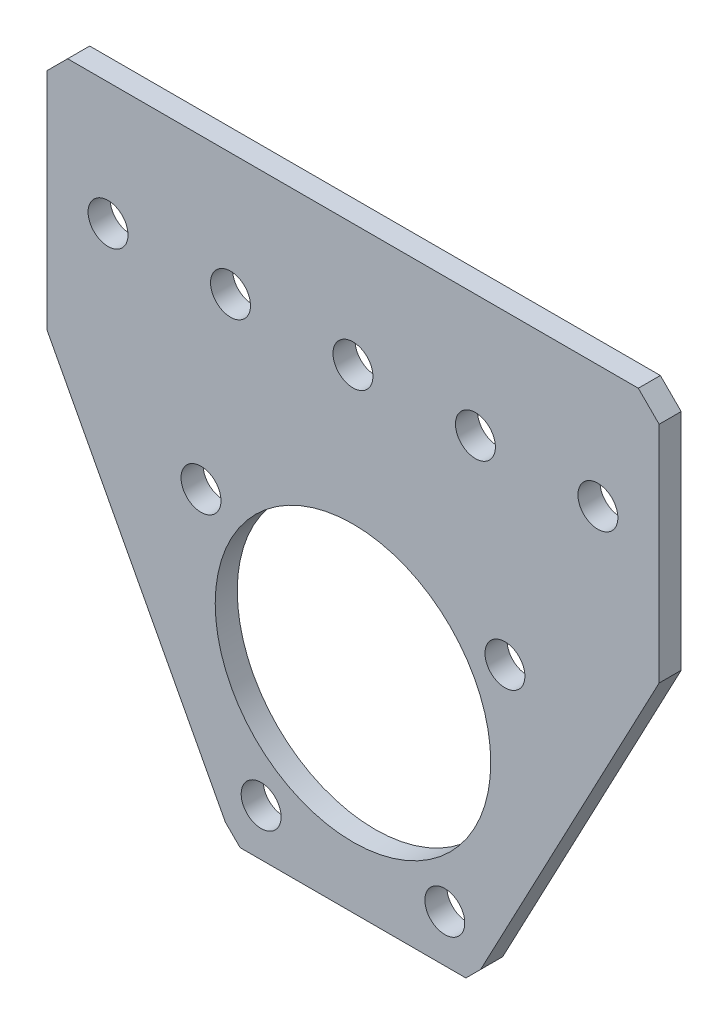
ISO-10303-21;
HEADER;
FILE_DESCRIPTION(('STEP AP214'),'2;1');
FILE_NAME('part.step','',(''),(''),'','','');
FILE_SCHEMA(('AUTOMOTIVE_DESIGN { 1 0 10303 214 1 1 1 1 }'));
ENDSEC;
DATA;
#1=APPLICATION_CONTEXT('core data for automotive mechanical design processes');
#2=APPLICATION_PROTOCOL_DEFINITION('international standard','automotive_design',2000,#1);
#3=PRODUCT_CONTEXT('',#1,'mechanical');
#4=PRODUCT('Part','Part','',(#3));
#5=PRODUCT_RELATED_PRODUCT_CATEGORY('part','',(#4));
#6=PRODUCT_DEFINITION_FORMATION('','',#4);
#7=PRODUCT_DEFINITION_CONTEXT('part definition',#1,'design');
#8=PRODUCT_DEFINITION('design','',#6,#7);
#9=PRODUCT_DEFINITION_SHAPE('','',#8);
#10=(LENGTH_UNIT() NAMED_UNIT(*) SI_UNIT(.MILLI.,.METRE.));
#11=(NAMED_UNIT(*) PLANE_ANGLE_UNIT() SI_UNIT($,.RADIAN.));
#12=(NAMED_UNIT(*) SI_UNIT($,.STERADIAN.) SOLID_ANGLE_UNIT());
#13=UNCERTAINTY_MEASURE_WITH_UNIT(LENGTH_MEASURE(1.E-05),#10,'distance_accuracy_value','');
#14=(GEOMETRIC_REPRESENTATION_CONTEXT(3) GLOBAL_UNCERTAINTY_ASSIGNED_CONTEXT((#13)) GLOBAL_UNIT_ASSIGNED_CONTEXT((#10,
#11,#12)) REPRESENTATION_CONTEXT('',''));
#15=CARTESIAN_POINT('',(0.,0.,0.));
#16=DIRECTION('',(0.,0.,1.));
#17=DIRECTION('',(1.,0.,0.));
#18=AXIS2_PLACEMENT_3D('',#15,#16,#17);
#19=CARTESIAN_POINT('',(31.75,41.275,0.));
#20=DIRECTION('',(0.,0.,-1.));
#21=DIRECTION('',(-1.,0.,0.));
#22=AXIS2_PLACEMENT_3D('',#19,#20,#21);
#23=PLANE('',#22);
#24=DIRECTION('',(0.707106781186548,-0.707106781186548,0.));
#25=VECTOR('',#24,1.);
#26=CARTESIAN_POINT('',(29.591,41.275,0.));
#27=LINE('',#26,#25);
#28=CARTESIAN_POINT('',(29.591,41.275,0.));
#29=VERTEX_POINT('',#28);
#30=CARTESIAN_POINT('',(31.75,39.116,0.));
#31=VERTEX_POINT('',#30);
#32=EDGE_CURVE('E476',#29,#31,#27,.T.);
#33=ORIENTED_EDGE('',*,*,#32,.T.);
#34=DIRECTION('',(0.,1.,0.));
#35=VECTOR('',#34,1.);
#36=CARTESIAN_POINT('',(31.75,15.875,0.));
#37=LINE('',#36,#35);
#38=CARTESIAN_POINT('',(31.75,15.875,0.));
#39=VERTEX_POINT('',#38);
#40=EDGE_CURVE('E471',#31,#39,#37,.F.);
#41=ORIENTED_EDGE('',*,*,#40,.T.);
#42=DIRECTION('',(-0.46773621594641,-0.883868107973205,0.));
#43=VECTOR('',#42,1.);
#44=CARTESIAN_POINT('',(31.75,15.875,0.));
#45=LINE('',#44,#43);
#46=CARTESIAN_POINT('',(13.2357534010395,-19.1108564594182,0.));
#47=VERTEX_POINT('',#46);
#48=EDGE_CURVE('E466',#39,#47,#45,.T.);
#49=ORIENTED_EDGE('',*,*,#48,.T.);
#50=DIRECTION('',(0.70710678118655,0.707106781186545,0.));
#51=VECTOR('',#50,1.);
#52=CARTESIAN_POINT('',(16.1733049302288,-16.173304930229,0.));
#53=LINE('',#52,#51);
#54=CARTESIAN_POINT('',(11.7091098604577,-20.6375,0.));
#55=VERTEX_POINT('',#54);
#56=EDGE_CURVE('E108',#55,#47,#53,.T.);
#57=ORIENTED_EDGE('',*,*,#56,.F.);
#58=DIRECTION('',(-1.,0.,0.));
#59=VECTOR('',#58,1.);
#60=CARTESIAN_POINT('',(12.4278653617164,-20.6375,0.));
#61=LINE('',#60,#59);
#62=CARTESIAN_POINT('',(-11.7091098604578,-20.6375,0.));
#63=VERTEX_POINT('',#62);
#64=EDGE_CURVE('E103',#55,#63,#61,.T.);
#65=ORIENTED_EDGE('',*,*,#64,.T.);
#66=DIRECTION('',(0.707106781186544,-0.707106781186551,0.));
#67=VECTOR('',#66,1.);
#68=CARTESIAN_POINT('',(-16.1733049302289,-16.1733049302288,0.));
#69=LINE('',#68,#67);
#70=CARTESIAN_POINT('',(-13.2357534010395,-19.1108564594182,0.));
#71=VERTEX_POINT('',#70);
#72=EDGE_CURVE('E94',#71,#63,#69,.T.);
#73=ORIENTED_EDGE('',*,*,#72,.F.);
#74=DIRECTION('',(-0.46773621594641,0.883868107973205,0.));
#75=VECTOR('',#74,1.);
#76=CARTESIAN_POINT('',(-31.75,15.875,0.));
#77=LINE('',#76,#75);
#78=CARTESIAN_POINT('',(-31.75,15.875,0.));
#79=VERTEX_POINT('',#78);
#80=EDGE_CURVE('E89',#71,#79,#77,.T.);
#81=ORIENTED_EDGE('',*,*,#80,.T.);
#82=DIRECTION('',(0.,1.,0.));
#83=VECTOR('',#82,1.);
#84=CARTESIAN_POINT('',(-31.75,15.875,0.));
#85=LINE('',#84,#83);
#86=CARTESIAN_POINT('',(-31.75,39.116,0.));
#87=VERTEX_POINT('',#86);
#88=EDGE_CURVE('E491',#79,#87,#85,.T.);
#89=ORIENTED_EDGE('',*,*,#88,.T.);
#90=DIRECTION('',(0.707106781186548,0.707106781186548,0.));
#91=VECTOR('',#90,1.);
#92=CARTESIAN_POINT('',(-31.75,39.116,0.));
#93=LINE('',#92,#91);
#94=CARTESIAN_POINT('',(-29.591,41.275,0.));
#95=VERTEX_POINT('',#94);
#96=EDGE_CURVE('E486',#87,#95,#93,.T.);
#97=ORIENTED_EDGE('',*,*,#96,.T.);
#98=DIRECTION('',(1.,0.,0.));
#99=VECTOR('',#98,1.);
#100=CARTESIAN_POINT('',(-31.75,41.275,0.));
#101=LINE('',#100,#99);
#102=EDGE_CURVE('E481',#95,#29,#101,.T.);
#103=ORIENTED_EDGE('',*,*,#102,.T.);
#104=EDGE_LOOP('',(#33,#41,#49,#57,#65,#73,#81,#89,#97,#103));
#105=FACE_BOUND('',#104,.T.);
#106=CARTESIAN_POINT('',(15.7602855304084,9.525,0.));
#107=DIRECTION('',(0.,0.,-1.));
#108=DIRECTION('',(-1.,0.,0.));
#109=AXIS2_PLACEMENT_3D('',#106,#107,#108);
#110=CIRCLE('',#109,2.0701);
#111=CARTESIAN_POINT('',(13.6901855304084,9.525,0.));
#112=VERTEX_POINT('',#111);
#113=EDGE_CURVE('E112',#112,#112,#110,.F.);
#114=ORIENTED_EDGE('',*,*,#113,.T.);
#115=EDGE_LOOP('',(#114));
#116=FACE_BOUND('',#115,.T.);
#117=CARTESIAN_POINT('',(-9.525,-15.7602855304084,0.));
#118=DIRECTION('',(0.,0.,-1.));
#119=DIRECTION('',(-1.,0.,0.));
#120=AXIS2_PLACEMENT_3D('',#117,#118,#119);
#121=CIRCLE('',#120,2.0701);
#122=CARTESIAN_POINT('',(-11.5951,-15.7602855304084,0.));
#123=VERTEX_POINT('',#122);
#124=EDGE_CURVE('E153',#123,#123,#121,.F.);
#125=ORIENTED_EDGE('',*,*,#124,.T.);
#126=EDGE_LOOP('',(#125));
#127=FACE_BOUND('',#126,.T.);
#128=CARTESIAN_POINT('',(12.7,28.575,0.));
#129=DIRECTION('',(0.,0.,-1.));
#130=DIRECTION('',(-1.,0.,0.));
#131=AXIS2_PLACEMENT_3D('',#128,#129,#130);
#132=CIRCLE('',#131,2.0701);
#133=CARTESIAN_POINT('',(10.6299,28.575,0.));
#134=VERTEX_POINT('',#133);
#135=EDGE_CURVE('E156',#134,#134,#132,.F.);
#136=ORIENTED_EDGE('',*,*,#135,.T.);
#137=EDGE_LOOP('',(#136));
#138=FACE_BOUND('',#137,.T.);
#139=CARTESIAN_POINT('',(-12.7,28.575,0.));
#140=DIRECTION('',(0.,0.,-1.));
#141=DIRECTION('',(-1.,0.,0.));
#142=AXIS2_PLACEMENT_3D('',#139,#140,#141);
#143=CIRCLE('',#142,2.0701);
#144=CARTESIAN_POINT('',(-14.7701,28.575,0.));
#145=VERTEX_POINT('',#144);
#146=EDGE_CURVE('E159',#145,#145,#143,.F.);
#147=ORIENTED_EDGE('',*,*,#146,.T.);
#148=EDGE_LOOP('',(#147));
#149=FACE_BOUND('',#148,.T.);
#150=CARTESIAN_POINT('',(-25.4,28.575,0.));
#151=DIRECTION('',(0.,0.,-1.));
#152=DIRECTION('',(-1.,0.,0.));
#153=AXIS2_PLACEMENT_3D('',#150,#151,#152);
#154=CIRCLE('',#153,2.0701);
#155=CARTESIAN_POINT('',(-27.4701,28.575,0.));
#156=VERTEX_POINT('',#155);
#157=EDGE_CURVE('E162',#156,#156,#154,.F.);
#158=ORIENTED_EDGE('',*,*,#157,.T.);
#159=EDGE_LOOP('',(#158));
#160=FACE_BOUND('',#159,.T.);
#161=CARTESIAN_POINT('',(0.,0.,0.));
#162=DIRECTION('',(0.,0.,-1.));
#163=DIRECTION('',(-1.,0.,0.));
#164=AXIS2_PLACEMENT_3D('',#161,#162,#163);
#165=CIRCLE('',#164,14.2875);
#166=CARTESIAN_POINT('',(-14.2875,0.,0.));
#167=VERTEX_POINT('',#166);
#168=EDGE_CURVE('E165',#167,#167,#165,.F.);
#169=ORIENTED_EDGE('',*,*,#168,.T.);
#170=EDGE_LOOP('',(#169));
#171=FACE_BOUND('',#170,.T.);
#172=CARTESIAN_POINT('',(25.4,28.575,0.));
#173=DIRECTION('',(0.,0.,-1.));
#174=DIRECTION('',(-1.,0.,0.));
#175=AXIS2_PLACEMENT_3D('',#172,#173,#174);
#176=CIRCLE('',#175,2.0701);
#177=CARTESIAN_POINT('',(23.3299,28.575,0.));
#178=VERTEX_POINT('',#177);
#179=EDGE_CURVE('E168',#178,#178,#176,.F.);
#180=ORIENTED_EDGE('',*,*,#179,.T.);
#181=EDGE_LOOP('',(#180));
#182=FACE_BOUND('',#181,.T.);
#183=CARTESIAN_POINT('',(0.,28.575,0.));
#184=DIRECTION('',(0.,0.,-1.));
#185=DIRECTION('',(-1.,0.,0.));
#186=AXIS2_PLACEMENT_3D('',#183,#184,#185);
#187=CIRCLE('',#186,2.0701);
#188=CARTESIAN_POINT('',(-2.0701,28.575,0.));
#189=VERTEX_POINT('',#188);
#190=EDGE_CURVE('E171',#189,#189,#187,.F.);
#191=ORIENTED_EDGE('',*,*,#190,.T.);
#192=EDGE_LOOP('',(#191));
#193=FACE_BOUND('',#192,.T.);
#194=CARTESIAN_POINT('',(-15.7602855304084,9.525,0.));
#195=DIRECTION('',(0.,0.,-1.));
#196=DIRECTION('',(-1.,0.,0.));
#197=AXIS2_PLACEMENT_3D('',#194,#195,#196);
#198=CIRCLE('',#197,2.0701);
#199=CARTESIAN_POINT('',(-17.8303855304084,9.525,0.));
#200=VERTEX_POINT('',#199);
#201=EDGE_CURVE('E173',#200,#200,#198,.F.);
#202=ORIENTED_EDGE('',*,*,#201,.T.);
#203=EDGE_LOOP('',(#202));
#204=FACE_BOUND('',#203,.T.);
#205=CARTESIAN_POINT('',(9.525,-15.7602855304084,0.));
#206=DIRECTION('',(0.,0.,-1.));
#207=DIRECTION('',(-1.,0.,0.));
#208=AXIS2_PLACEMENT_3D('',#205,#206,#207);
#209=CIRCLE('',#208,2.0701);
#210=CARTESIAN_POINT('',(7.4549,-15.7602855304084,0.));
#211=VERTEX_POINT('',#210);
#212=EDGE_CURVE('E20',#211,#211,#209,.F.);
#213=ORIENTED_EDGE('',*,*,#212,.T.);
#214=EDGE_LOOP('',(#213));
#215=FACE_BOUND('',#214,.T.);
#216=ADVANCED_FACE('F17',(#105,#116,#127,#138,#149,#160,#171,#182,#193,#204,#215),#23,.T.);
#217=CARTESIAN_POINT('',(9.525,-15.7602855304084,2.286));
#218=DIRECTION('',(0.,0.,-1.));
#219=DIRECTION('',(-1.,0.,0.));
#220=AXIS2_PLACEMENT_3D('',#217,#218,#219);
#221=CYLINDRICAL_SURFACE('',#220,2.0701);
#222=ORIENTED_EDGE('',*,*,#212,.F.);
#223=EDGE_LOOP('',(#222));
#224=FACE_BOUND('',#223,.T.);
#225=CARTESIAN_POINT('',(9.525,-15.7602855304084,2.286));
#226=DIRECTION('',(0.,0.,-1.));
#227=DIRECTION('',(-1.,0.,0.));
#228=AXIS2_PLACEMENT_3D('',#225,#226,#227);
#229=CIRCLE('',#228,2.0701);
#230=CARTESIAN_POINT('',(7.4549,-15.7602855304084,2.286));
#231=VERTEX_POINT('',#230);
#232=EDGE_CURVE('E148',#231,#231,#229,.F.);
#233=ORIENTED_EDGE('',*,*,#232,.T.);
#234=EDGE_LOOP('',(#233));
#235=FACE_BOUND('',#234,.T.);
#236=ADVANCED_FACE('F181',(#224,#235),#221,.F.);
#237=CARTESIAN_POINT('',(-15.7602855304084,9.525,2.286));
#238=DIRECTION('',(0.,0.,-1.));
#239=DIRECTION('',(-1.,0.,0.));
#240=AXIS2_PLACEMENT_3D('',#237,#238,#239);
#241=CYLINDRICAL_SURFACE('',#240,2.0701);
#242=ORIENTED_EDGE('',*,*,#201,.F.);
#243=EDGE_LOOP('',(#242));
#244=FACE_BOUND('',#243,.T.);
#245=CARTESIAN_POINT('',(-15.7602855304084,9.525,2.286));
#246=DIRECTION('',(0.,0.,-1.));
#247=DIRECTION('',(-1.,0.,0.));
#248=AXIS2_PLACEMENT_3D('',#245,#246,#247);
#249=CIRCLE('',#248,2.0701);
#250=CARTESIAN_POINT('',(-17.8303855304084,9.525,2.286));
#251=VERTEX_POINT('',#250);
#252=EDGE_CURVE('E145',#251,#251,#249,.F.);
#253=ORIENTED_EDGE('',*,*,#252,.T.);
#254=EDGE_LOOP('',(#253));
#255=FACE_BOUND('',#254,.T.);
#256=ADVANCED_FACE('F184',(#244,#255),#241,.F.);
#257=CARTESIAN_POINT('',(0.,28.575,2.286));
#258=DIRECTION('',(0.,0.,-1.));
#259=DIRECTION('',(-1.,0.,0.));
#260=AXIS2_PLACEMENT_3D('',#257,#258,#259);
#261=CYLINDRICAL_SURFACE('',#260,2.0701);
#262=ORIENTED_EDGE('',*,*,#190,.F.);
#263=EDGE_LOOP('',(#262));
#264=FACE_BOUND('',#263,.T.);
#265=CARTESIAN_POINT('',(0.,28.575,2.286));
#266=DIRECTION('',(0.,0.,-1.));
#267=DIRECTION('',(-1.,0.,0.));
#268=AXIS2_PLACEMENT_3D('',#265,#266,#267);
#269=CIRCLE('',#268,2.0701);
#270=CARTESIAN_POINT('',(-2.0701,28.575,2.286));
#271=VERTEX_POINT('',#270);
#272=EDGE_CURVE('E142',#271,#271,#269,.F.);
#273=ORIENTED_EDGE('',*,*,#272,.T.);
#274=EDGE_LOOP('',(#273));
#275=FACE_BOUND('',#274,.T.);
#276=ADVANCED_FACE('F258',(#264,#275),#261,.F.);
#277=CARTESIAN_POINT('',(25.4,28.575,2.286));
#278=DIRECTION('',(0.,0.,-1.));
#279=DIRECTION('',(-1.,0.,0.));
#280=AXIS2_PLACEMENT_3D('',#277,#278,#279);
#281=CYLINDRICAL_SURFACE('',#280,2.0701);
#282=ORIENTED_EDGE('',*,*,#179,.F.);
#283=EDGE_LOOP('',(#282));
#284=FACE_BOUND('',#283,.T.);
#285=CARTESIAN_POINT('',(25.4,28.575,2.286));
#286=DIRECTION('',(0.,0.,-1.));
#287=DIRECTION('',(-1.,0.,0.));
#288=AXIS2_PLACEMENT_3D('',#285,#286,#287);
#289=CIRCLE('',#288,2.0701);
#290=CARTESIAN_POINT('',(23.3299,28.575,2.286));
#291=VERTEX_POINT('',#290);
#292=EDGE_CURVE('E139',#291,#291,#289,.F.);
#293=ORIENTED_EDGE('',*,*,#292,.T.);
#294=EDGE_LOOP('',(#293));
#295=FACE_BOUND('',#294,.T.);
#296=ADVANCED_FACE('F254',(#284,#295),#281,.F.);
#297=CARTESIAN_POINT('',(0.,0.,2.286));
#298=DIRECTION('',(0.,0.,-1.));
#299=DIRECTION('',(-1.,0.,0.));
#300=AXIS2_PLACEMENT_3D('',#297,#298,#299);
#301=CYLINDRICAL_SURFACE('',#300,14.2875);
#302=ORIENTED_EDGE('',*,*,#168,.F.);
#303=EDGE_LOOP('',(#302));
#304=FACE_BOUND('',#303,.T.);
#305=CARTESIAN_POINT('',(0.,0.,2.286));
#306=DIRECTION('',(0.,0.,-1.));
#307=DIRECTION('',(-1.,0.,0.));
#308=AXIS2_PLACEMENT_3D('',#305,#306,#307);
#309=CIRCLE('',#308,14.2875);
#310=CARTESIAN_POINT('',(-14.2875,0.,2.286));
#311=VERTEX_POINT('',#310);
#312=EDGE_CURVE('E136',#311,#311,#309,.F.);
#313=ORIENTED_EDGE('',*,*,#312,.T.);
#314=EDGE_LOOP('',(#313));
#315=FACE_BOUND('',#314,.T.);
#316=ADVANCED_FACE('F250',(#304,#315),#301,.F.);
#317=CARTESIAN_POINT('',(-25.4,28.575,2.286));
#318=DIRECTION('',(0.,0.,-1.));
#319=DIRECTION('',(-1.,0.,0.));
#320=AXIS2_PLACEMENT_3D('',#317,#318,#319);
#321=CYLINDRICAL_SURFACE('',#320,2.0701);
#322=ORIENTED_EDGE('',*,*,#157,.F.);
#323=EDGE_LOOP('',(#322));
#324=FACE_BOUND('',#323,.T.);
#325=CARTESIAN_POINT('',(-25.4,28.575,2.286));
#326=DIRECTION('',(0.,0.,-1.));
#327=DIRECTION('',(-1.,0.,0.));
#328=AXIS2_PLACEMENT_3D('',#325,#326,#327);
#329=CIRCLE('',#328,2.0701);
#330=CARTESIAN_POINT('',(-27.4701,28.575,2.286));
#331=VERTEX_POINT('',#330);
#332=EDGE_CURVE('E133',#331,#331,#329,.F.);
#333=ORIENTED_EDGE('',*,*,#332,.T.);
#334=EDGE_LOOP('',(#333));
#335=FACE_BOUND('',#334,.T.);
#336=ADVANCED_FACE('F246',(#324,#335),#321,.F.);
#337=CARTESIAN_POINT('',(-12.7,28.575,2.286));
#338=DIRECTION('',(0.,0.,-1.));
#339=DIRECTION('',(-1.,0.,0.));
#340=AXIS2_PLACEMENT_3D('',#337,#338,#339);
#341=CYLINDRICAL_SURFACE('',#340,2.0701);
#342=ORIENTED_EDGE('',*,*,#146,.F.);
#343=EDGE_LOOP('',(#342));
#344=FACE_BOUND('',#343,.T.);
#345=CARTESIAN_POINT('',(-12.7,28.575,2.286));
#346=DIRECTION('',(0.,0.,-1.));
#347=DIRECTION('',(-1.,0.,0.));
#348=AXIS2_PLACEMENT_3D('',#345,#346,#347);
#349=CIRCLE('',#348,2.0701);
#350=CARTESIAN_POINT('',(-14.7701,28.575,2.286));
#351=VERTEX_POINT('',#350);
#352=EDGE_CURVE('E130',#351,#351,#349,.F.);
#353=ORIENTED_EDGE('',*,*,#352,.T.);
#354=EDGE_LOOP('',(#353));
#355=FACE_BOUND('',#354,.T.);
#356=ADVANCED_FACE('F242',(#344,#355),#341,.F.);
#357=CARTESIAN_POINT('',(12.7,28.575,2.286));
#358=DIRECTION('',(0.,0.,-1.));
#359=DIRECTION('',(-1.,0.,0.));
#360=AXIS2_PLACEMENT_3D('',#357,#358,#359);
#361=CYLINDRICAL_SURFACE('',#360,2.0701);
#362=ORIENTED_EDGE('',*,*,#135,.F.);
#363=EDGE_LOOP('',(#362));
#364=FACE_BOUND('',#363,.T.);
#365=CARTESIAN_POINT('',(12.7,28.575,2.286));
#366=DIRECTION('',(0.,0.,-1.));
#367=DIRECTION('',(-1.,0.,0.));
#368=AXIS2_PLACEMENT_3D('',#365,#366,#367);
#369=CIRCLE('',#368,2.0701);
#370=CARTESIAN_POINT('',(10.6299,28.575,2.286));
#371=VERTEX_POINT('',#370);
#372=EDGE_CURVE('E127',#371,#371,#369,.F.);
#373=ORIENTED_EDGE('',*,*,#372,.T.);
#374=EDGE_LOOP('',(#373));
#375=FACE_BOUND('',#374,.T.);
#376=ADVANCED_FACE('F238',(#364,#375),#361,.F.);
#377=CARTESIAN_POINT('',(-9.525,-15.7602855304084,2.286));
#378=DIRECTION('',(0.,0.,-1.));
#379=DIRECTION('',(-1.,0.,0.));
#380=AXIS2_PLACEMENT_3D('',#377,#378,#379);
#381=CYLINDRICAL_SURFACE('',#380,2.0701);
#382=ORIENTED_EDGE('',*,*,#124,.F.);
#383=EDGE_LOOP('',(#382));
#384=FACE_BOUND('',#383,.T.);
#385=CARTESIAN_POINT('',(-9.525,-15.7602855304084,2.286));
#386=DIRECTION('',(0.,0.,-1.));
#387=DIRECTION('',(-1.,0.,0.));
#388=AXIS2_PLACEMENT_3D('',#385,#386,#387);
#389=CIRCLE('',#388,2.0701);
#390=CARTESIAN_POINT('',(-11.5951,-15.7602855304084,2.286));
#391=VERTEX_POINT('',#390);
#392=EDGE_CURVE('E124',#391,#391,#389,.F.);
#393=ORIENTED_EDGE('',*,*,#392,.T.);
#394=EDGE_LOOP('',(#393));
#395=FACE_BOUND('',#394,.T.);
#396=ADVANCED_FACE('F234',(#384,#395),#381,.F.);
#397=CARTESIAN_POINT('',(15.7602855304084,9.525,2.286));
#398=DIRECTION('',(0.,0.,-1.));
#399=DIRECTION('',(-1.,0.,0.));
#400=AXIS2_PLACEMENT_3D('',#397,#398,#399);
#401=CYLINDRICAL_SURFACE('',#400,2.0701);
#402=ORIENTED_EDGE('',*,*,#113,.F.);
#403=EDGE_LOOP('',(#402));
#404=FACE_BOUND('',#403,.T.);
#405=CARTESIAN_POINT('',(15.7602855304084,9.525,2.286));
#406=DIRECTION('',(0.,0.,-1.));
#407=DIRECTION('',(-1.,0.,0.));
#408=AXIS2_PLACEMENT_3D('',#405,#406,#407);
#409=CIRCLE('',#408,2.0701);
#410=CARTESIAN_POINT('',(13.6901855304084,9.525,2.286));
#411=VERTEX_POINT('',#410);
#412=EDGE_CURVE('E121',#411,#411,#409,.F.);
#413=ORIENTED_EDGE('',*,*,#412,.T.);
#414=EDGE_LOOP('',(#413));
#415=FACE_BOUND('',#414,.T.);
#416=ADVANCED_FACE('F231',(#404,#415),#401,.F.);
#417=CARTESIAN_POINT('',(12.4278653617164,-20.6375,2.286));
#418=DIRECTION('',(0.,1.,0.));
#419=DIRECTION('',(-1.,0.,0.));
#420=AXIS2_PLACEMENT_3D('',#417,#418,#419);
#421=PLANE('',#420);
#422=DIRECTION('',(-1.,0.,0.));
#423=VECTOR('',#422,1.);
#424=CARTESIAN_POINT('',(31.75,-20.6375,2.286));
#425=LINE('',#424,#423);
#426=CARTESIAN_POINT('',(11.7091098604577,-20.6375,2.286));
#427=VERTEX_POINT('',#426);
#428=CARTESIAN_POINT('',(-11.7091098604578,-20.6375,2.286));
#429=VERTEX_POINT('',#428);
#430=EDGE_CURVE('E116',#427,#429,#425,.T.);
#431=ORIENTED_EDGE('',*,*,#430,.T.);
#432=DIRECTION('',(0.,0.,1.));
#433=VECTOR('',#432,1.);
#434=CARTESIAN_POINT('',(-11.7091098604578,-20.6375,0.));
#435=LINE('',#434,#433);
#436=EDGE_CURVE('E99',#63,#429,#435,.T.);
#437=ORIENTED_EDGE('',*,*,#436,.F.);
#438=ORIENTED_EDGE('',*,*,#64,.F.);
#439=DIRECTION('',(0.,0.,1.));
#440=VECTOR('',#439,1.);
#441=CARTESIAN_POINT('',(11.7091098604577,-20.6375,0.));
#442=LINE('',#441,#440);
#443=EDGE_CURVE('E464',#427,#55,#442,.F.);
#444=ORIENTED_EDGE('',*,*,#443,.F.);
#445=EDGE_LOOP('',(#431,#437,#438,#444));
#446=FACE_BOUND('',#445,.T.);
#447=ADVANCED_FACE('F115',(#446),#421,.F.);
#448=CARTESIAN_POINT('',(-16.1733049302289,-16.1733049302288,0.));
#449=DIRECTION('',(-0.707106781186551,-0.707106781186544,0.));
#450=DIRECTION('',(0.707106781186544,-0.707106781186551,0.));
#451=AXIS2_PLACEMENT_3D('',#448,#449,#450);
#452=PLANE('',#451);
#453=ORIENTED_EDGE('',*,*,#72,.T.);
#454=ORIENTED_EDGE('',*,*,#436,.T.);
#455=DIRECTION('',(-0.707106781186544,0.707106781186551,0.));
#456=VECTOR('',#455,1.);
#457=CARTESIAN_POINT('',(-11.7091098604578,-20.6375,2.286));
#458=LINE('',#457,#456);
#459=CARTESIAN_POINT('',(-13.2357534010395,-19.1108564594182,2.286));
#460=VERTEX_POINT('',#459);
#461=EDGE_CURVE('E453',#429,#460,#458,.T.);
#462=ORIENTED_EDGE('',*,*,#461,.T.);
#463=DIRECTION('',(0.,0.,1.));
#464=VECTOR('',#463,1.);
#465=CARTESIAN_POINT('',(-13.2357534010395,-19.1108564594182,2.286));
#466=LINE('',#465,#464);
#467=EDGE_CURVE('E101',#460,#71,#466,.F.);
#468=ORIENTED_EDGE('',*,*,#467,.T.);
#469=EDGE_LOOP('',(#453,#454,#462,#468));
#470=FACE_BOUND('',#469,.T.);
#471=ADVANCED_FACE('F96',(#470),#452,.T.);
#472=CARTESIAN_POINT('',(-31.75,15.875,2.286));
#473=DIRECTION('',(0.883868107973205,0.46773621594641,0.));
#474=DIRECTION('',(-0.46773621594641,0.883868107973205,0.));
#475=AXIS2_PLACEMENT_3D('',#472,#473,#474);
#476=PLANE('',#475);
#477=DIRECTION('',(-0.46773621594641,0.883868107973205,0.));
#478=VECTOR('',#477,1.);
#479=CARTESIAN_POINT('',(-13.2357534010395,-19.1108564594182,2.286));
#480=LINE('',#479,#478);
#481=CARTESIAN_POINT('',(-31.75,15.875,2.286));
#482=VERTEX_POINT('',#481);
#483=EDGE_CURVE('E449',#460,#482,#480,.T.);
#484=ORIENTED_EDGE('',*,*,#483,.T.);
#485=DIRECTION('',(0.,0.,-1.));
#486=VECTOR('',#485,1.);
#487=CARTESIAN_POINT('',(-31.75,15.875,2.286));
#488=LINE('',#487,#486);
#489=EDGE_CURVE('E450',#482,#79,#488,.T.);
#490=ORIENTED_EDGE('',*,*,#489,.T.);
#491=ORIENTED_EDGE('',*,*,#80,.F.);
#492=ORIENTED_EDGE('',*,*,#467,.F.);
#493=EDGE_LOOP('',(#484,#490,#491,#492));
#494=FACE_BOUND('',#493,.T.);
#495=ADVANCED_FACE('F223',(#494),#476,.F.);
#496=CARTESIAN_POINT('',(-31.75,15.875,2.286));
#497=DIRECTION('',(1.,0.,0.));
#498=DIRECTION('',(0.,0.,-1.));
#499=AXIS2_PLACEMENT_3D('',#496,#497,#498);
#500=PLANE('',#499);
#501=DIRECTION('',(0.,0.,1.));
#502=VECTOR('',#501,1.);
#503=CARTESIAN_POINT('',(-31.75,39.116,2.286));
#504=LINE('',#503,#502);
#505=CARTESIAN_POINT('',(-31.75,39.116,2.286));
#506=VERTEX_POINT('',#505);
#507=EDGE_CURVE('E488',#506,#87,#504,.F.);
#508=ORIENTED_EDGE('',*,*,#507,.T.);
#509=ORIENTED_EDGE('',*,*,#88,.F.);
#510=ORIENTED_EDGE('',*,*,#489,.F.);
#511=DIRECTION('',(0.,1.,0.));
#512=VECTOR('',#511,1.);
#513=CARTESIAN_POINT('',(-31.75,41.275,2.286));
#514=LINE('',#513,#512);
#515=EDGE_CURVE('E452',#482,#506,#514,.T.);
#516=ORIENTED_EDGE('',*,*,#515,.T.);
#517=EDGE_LOOP('',(#508,#509,#510,#516));
#518=FACE_BOUND('',#517,.T.);
#519=ADVANCED_FACE('F219',(#518),#500,.F.);
#520=CARTESIAN_POINT('',(-31.75,39.116,2.286));
#521=DIRECTION('',(0.707106781186548,-0.707106781186548,0.));
#522=DIRECTION('',(0.707106781186548,0.707106781186548,0.));
#523=AXIS2_PLACEMENT_3D('',#520,#521,#522);
#524=PLANE('',#523);
#525=DIRECTION('',(0.,0.,-1.));
#526=VECTOR('',#525,1.);
#527=CARTESIAN_POINT('',(-29.591,41.275,2.286));
#528=LINE('',#527,#526);
#529=CARTESIAN_POINT('',(-29.591,41.275,2.286));
#530=VERTEX_POINT('',#529);
#531=EDGE_CURVE('E483',#530,#95,#528,.T.);
#532=ORIENTED_EDGE('',*,*,#531,.T.);
#533=ORIENTED_EDGE('',*,*,#96,.F.);
#534=ORIENTED_EDGE('',*,*,#507,.F.);
#535=DIRECTION('',(0.707106781186546,0.707106781186549,0.));
#536=VECTOR('',#535,1.);
#537=CARTESIAN_POINT('',(-31.75,39.116,2.286));
#538=LINE('',#537,#536);
#539=EDGE_CURVE('E456',#506,#530,#538,.T.);
#540=ORIENTED_EDGE('',*,*,#539,.T.);
#541=EDGE_LOOP('',(#532,#533,#534,#540));
#542=FACE_BOUND('',#541,.T.);
#543=ADVANCED_FACE('F215',(#542),#524,.F.);
#544=CARTESIAN_POINT('',(-31.75,41.275,2.286));
#545=DIRECTION('',(0.,-1.,0.));
#546=DIRECTION('',(0.,0.,-1.));
#547=AXIS2_PLACEMENT_3D('',#544,#545,#546);
#548=PLANE('',#547);
#549=DIRECTION('',(0.,0.,1.));
#550=VECTOR('',#549,1.);
#551=CARTESIAN_POINT('',(29.591,41.275,2.286));
#552=LINE('',#551,#550);
#553=CARTESIAN_POINT('',(29.591,41.275,2.286));
#554=VERTEX_POINT('',#553);
#555=EDGE_CURVE('E478',#554,#29,#552,.F.);
#556=ORIENTED_EDGE('',*,*,#555,.T.);
#557=ORIENTED_EDGE('',*,*,#102,.F.);
#558=ORIENTED_EDGE('',*,*,#531,.F.);
#559=DIRECTION('',(-1.,0.,0.));
#560=VECTOR('',#559,1.);
#561=CARTESIAN_POINT('',(31.75,41.275,2.286));
#562=LINE('',#561,#560);
#563=EDGE_CURVE('E501',#530,#554,#562,.F.);
#564=ORIENTED_EDGE('',*,*,#563,.T.);
#565=EDGE_LOOP('',(#556,#557,#558,#564));
#566=FACE_BOUND('',#565,.T.);
#567=ADVANCED_FACE('F211',(#566),#548,.F.);
#568=CARTESIAN_POINT('',(29.591,41.275,2.286));
#569=DIRECTION('',(-0.707106781186548,-0.707106781186548,0.));
#570=DIRECTION('',(0.707106781186548,-0.707106781186548,0.));
#571=AXIS2_PLACEMENT_3D('',#568,#569,#570);
#572=PLANE('',#571);
#573=DIRECTION('',(0.,0.,1.));
#574=VECTOR('',#573,1.);
#575=CARTESIAN_POINT('',(31.75,39.116,2.286));
#576=LINE('',#575,#574);
#577=CARTESIAN_POINT('',(31.75,39.116,2.286));
#578=VERTEX_POINT('',#577);
#579=EDGE_CURVE('E473',#578,#31,#576,.F.);
#580=ORIENTED_EDGE('',*,*,#579,.T.);
#581=ORIENTED_EDGE('',*,*,#32,.F.);
#582=ORIENTED_EDGE('',*,*,#555,.F.);
#583=DIRECTION('',(0.707106781186549,-0.707106781186546,0.));
#584=VECTOR('',#583,1.);
#585=CARTESIAN_POINT('',(29.591,41.275,2.286));
#586=LINE('',#585,#584);
#587=EDGE_CURVE('E502',#554,#578,#586,.T.);
#588=ORIENTED_EDGE('',*,*,#587,.T.);
#589=EDGE_LOOP('',(#580,#581,#582,#588));
#590=FACE_BOUND('',#589,.T.);
#591=ADVANCED_FACE('F207',(#590),#572,.F.);
#592=CARTESIAN_POINT('',(31.75,15.875,2.286));
#593=DIRECTION('',(-1.,0.,0.));
#594=DIRECTION('',(0.,0.,1.));
#595=AXIS2_PLACEMENT_3D('',#592,#593,#594);
#596=PLANE('',#595);
#597=ORIENTED_EDGE('',*,*,#579,.F.);
#598=DIRECTION('',(0.,1.,0.));
#599=VECTOR('',#598,1.);
#600=CARTESIAN_POINT('',(31.75,41.275,2.286));
#601=LINE('',#600,#599);
#602=CARTESIAN_POINT('',(31.75,15.875,2.286));
#603=VERTEX_POINT('',#602);
#604=EDGE_CURVE('E507',#578,#603,#601,.F.);
#605=ORIENTED_EDGE('',*,*,#604,.T.);
#606=DIRECTION('',(0.,0.,1.));
#607=VECTOR('',#606,1.);
#608=CARTESIAN_POINT('',(31.75,15.875,2.286));
#609=LINE('',#608,#607);
#610=EDGE_CURVE('E468',#603,#39,#609,.F.);
#611=ORIENTED_EDGE('',*,*,#610,.T.);
#612=ORIENTED_EDGE('',*,*,#40,.F.);
#613=EDGE_LOOP('',(#597,#605,#611,#612));
#614=FACE_BOUND('',#613,.T.);
#615=ADVANCED_FACE('F203',(#614),#596,.F.);
#616=CARTESIAN_POINT('',(31.75,15.875,2.286));
#617=DIRECTION('',(-0.883868107973205,0.46773621594641,0.));
#618=DIRECTION('',(-0.46773621594641,-0.883868107973205,0.));
#619=AXIS2_PLACEMENT_3D('',#616,#617,#618);
#620=PLANE('',#619);
#621=ORIENTED_EDGE('',*,*,#48,.F.);
#622=ORIENTED_EDGE('',*,*,#610,.F.);
#623=DIRECTION('',(-0.46773621594641,-0.883868107973205,0.));
#624=VECTOR('',#623,1.);
#625=CARTESIAN_POINT('',(31.75,15.875,2.286));
#626=LINE('',#625,#624);
#627=CARTESIAN_POINT('',(13.2357534010395,-19.1108564594183,2.286));
#628=VERTEX_POINT('',#627);
#629=EDGE_CURVE('E26',#603,#628,#626,.T.);
#630=ORIENTED_EDGE('',*,*,#629,.T.);
#631=DIRECTION('',(0.,0.,1.));
#632=VECTOR('',#631,1.);
#633=CARTESIAN_POINT('',(13.2357534010395,-19.1108564594183,0.));
#634=LINE('',#633,#632);
#635=EDGE_CURVE('E34',#47,#628,#634,.T.);
#636=ORIENTED_EDGE('',*,*,#635,.F.);
#637=EDGE_LOOP('',(#621,#622,#630,#636));
#638=FACE_BOUND('',#637,.T.);
#639=ADVANCED_FACE('F196',(#638),#620,.F.);
#640=CARTESIAN_POINT('',(16.1733049302288,-16.173304930229,0.));
#641=DIRECTION('',(0.707106781186545,-0.70710678118655,0.));
#642=DIRECTION('',(0.70710678118655,0.707106781186545,0.));
#643=AXIS2_PLACEMENT_3D('',#640,#641,#642);
#644=PLANE('',#643);
#645=ORIENTED_EDGE('',*,*,#56,.T.);
#646=ORIENTED_EDGE('',*,*,#635,.T.);
#647=DIRECTION('',(-0.707106781186552,-0.707106781186543,0.));
#648=VECTOR('',#647,1.);
#649=CARTESIAN_POINT('',(13.2357534010395,-19.1108564594183,2.286));
#650=LINE('',#649,#648);
#651=EDGE_CURVE('E10',#628,#427,#650,.T.);
#652=ORIENTED_EDGE('',*,*,#651,.T.);
#653=ORIENTED_EDGE('',*,*,#443,.T.);
#654=EDGE_LOOP('',(#645,#646,#652,#653));
#655=FACE_BOUND('',#654,.T.);
#656=ADVANCED_FACE('F189',(#655),#644,.T.);
#657=CARTESIAN_POINT('',(31.75,41.275,2.286));
#658=DIRECTION('',(0.,0.,-1.));
#659=DIRECTION('',(-1.,0.,0.));
#660=AXIS2_PLACEMENT_3D('',#657,#658,#659);
#661=PLANE('',#660);
#662=ORIENTED_EDGE('',*,*,#629,.F.);
#663=ORIENTED_EDGE('',*,*,#604,.F.);
#664=ORIENTED_EDGE('',*,*,#587,.F.);
#665=ORIENTED_EDGE('',*,*,#563,.F.);
#666=ORIENTED_EDGE('',*,*,#539,.F.);
#667=ORIENTED_EDGE('',*,*,#515,.F.);
#668=ORIENTED_EDGE('',*,*,#483,.F.);
#669=ORIENTED_EDGE('',*,*,#461,.F.);
#670=ORIENTED_EDGE('',*,*,#430,.F.);
#671=ORIENTED_EDGE('',*,*,#651,.F.);
#672=EDGE_LOOP('',(#662,#663,#664,#665,#666,#667,#668,#669,#670,#671));
#673=FACE_BOUND('',#672,.T.);
#674=ORIENTED_EDGE('',*,*,#412,.F.);
#675=EDGE_LOOP('',(#674));
#676=FACE_BOUND('',#675,.T.);
#677=ORIENTED_EDGE('',*,*,#392,.F.);
#678=EDGE_LOOP('',(#677));
#679=FACE_BOUND('',#678,.T.);
#680=ORIENTED_EDGE('',*,*,#372,.F.);
#681=EDGE_LOOP('',(#680));
#682=FACE_BOUND('',#681,.T.);
#683=ORIENTED_EDGE('',*,*,#352,.F.);
#684=EDGE_LOOP('',(#683));
#685=FACE_BOUND('',#684,.T.);
#686=ORIENTED_EDGE('',*,*,#332,.F.);
#687=EDGE_LOOP('',(#686));
#688=FACE_BOUND('',#687,.T.);
#689=ORIENTED_EDGE('',*,*,#312,.F.);
#690=EDGE_LOOP('',(#689));
#691=FACE_BOUND('',#690,.T.);
#692=ORIENTED_EDGE('',*,*,#292,.F.);
#693=EDGE_LOOP('',(#692));
#694=FACE_BOUND('',#693,.T.);
#695=ORIENTED_EDGE('',*,*,#272,.F.);
#696=EDGE_LOOP('',(#695));
#697=FACE_BOUND('',#696,.T.);
#698=ORIENTED_EDGE('',*,*,#252,.F.);
#699=EDGE_LOOP('',(#698));
#700=FACE_BOUND('',#699,.T.);
#701=ORIENTED_EDGE('',*,*,#232,.F.);
#702=EDGE_LOOP('',(#701));
#703=FACE_BOUND('',#702,.T.);
#704=ADVANCED_FACE('F187',(#673,#676,#679,#682,#685,#688,#691,#694,#697,#700,#703),#661,.F.);
#705=CLOSED_SHELL('',(#216,#236,#256,#276,#296,#316,#336,#356,#376,#396,#416,#447,#471,#495,
#519,#543,#567,#591,#615,#639,#656,#704));
#706=MANIFOLD_SOLID_BREP('B1',#705);
#707=ADVANCED_BREP_SHAPE_REPRESENTATION('',(#18,#706),#14);
#708=SHAPE_DEFINITION_REPRESENTATION(#9,#707);
ENDSEC;
END-ISO-10303-21;
